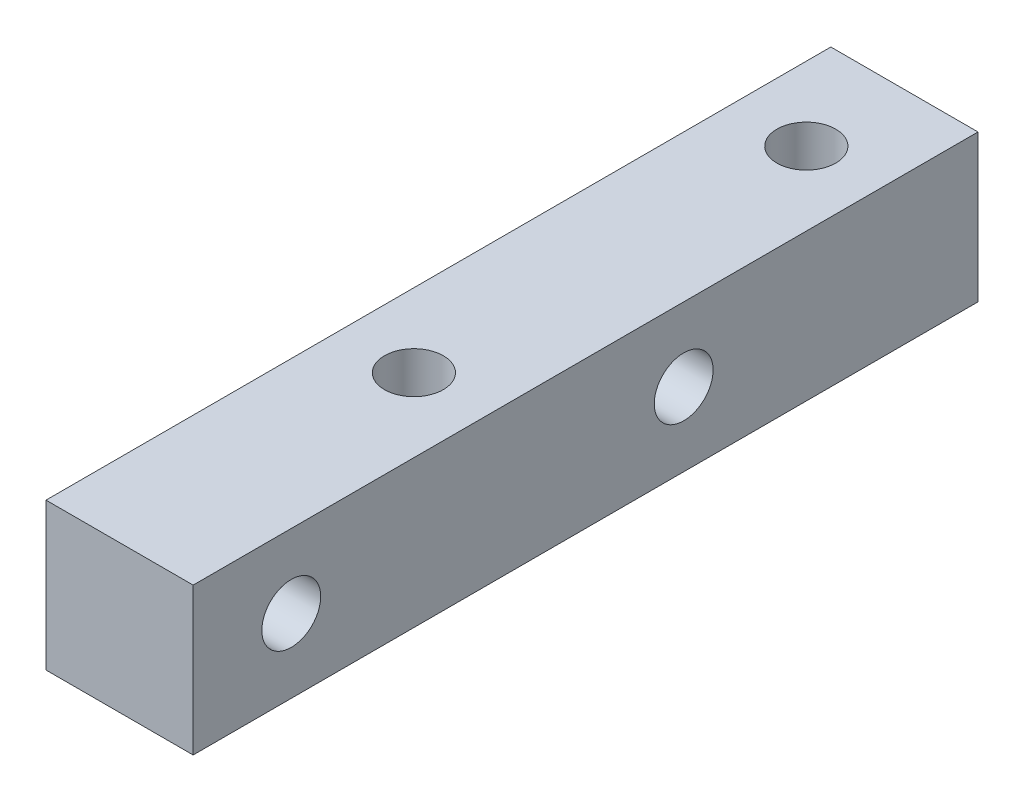
ISO-10303-21;
HEADER;
FILE_DESCRIPTION(('STEP AP214'),'2;1');
FILE_NAME('part.step','',(''),(''),'','','');
FILE_SCHEMA(('AUTOMOTIVE_DESIGN { 1 0 10303 214 1 1 1 1 }'));
ENDSEC;
DATA;
#1=APPLICATION_CONTEXT('core data for automotive mechanical design processes');
#2=APPLICATION_PROTOCOL_DEFINITION('international standard','automotive_design',2000,#1);
#3=PRODUCT_CONTEXT('',#1,'mechanical');
#4=PRODUCT('Part','Part','',(#3));
#5=PRODUCT_RELATED_PRODUCT_CATEGORY('part','',(#4));
#6=PRODUCT_DEFINITION_FORMATION('','',#4);
#7=PRODUCT_DEFINITION_CONTEXT('part definition',#1,'design');
#8=PRODUCT_DEFINITION('design','',#6,#7);
#9=PRODUCT_DEFINITION_SHAPE('','',#8);
#10=(LENGTH_UNIT() NAMED_UNIT(*) SI_UNIT(.MILLI.,.METRE.));
#11=(NAMED_UNIT(*) PLANE_ANGLE_UNIT() SI_UNIT($,.RADIAN.));
#12=(NAMED_UNIT(*) SI_UNIT($,.STERADIAN.) SOLID_ANGLE_UNIT());
#13=UNCERTAINTY_MEASURE_WITH_UNIT(LENGTH_MEASURE(1.E-05),#10,'distance_accuracy_value','');
#14=(GEOMETRIC_REPRESENTATION_CONTEXT(3) GLOBAL_UNCERTAINTY_ASSIGNED_CONTEXT((#13)) GLOBAL_UNIT_ASSIGNED_CONTEXT((#10,
#11,#12)) REPRESENTATION_CONTEXT('',''));
#15=CARTESIAN_POINT('',(0.,0.,0.));
#16=DIRECTION('',(0.,0.,1.));
#17=DIRECTION('',(1.,0.,0.));
#18=AXIS2_PLACEMENT_3D('',#15,#16,#17);
#19=CARTESIAN_POINT('',(0.,0.,32.));
#20=DIRECTION('',(1.,0.,0.));
#21=DIRECTION('',(0.,0.,-1.));
#22=AXIS2_PLACEMENT_3D('',#19,#20,#21);
#23=PLANE('',#22);
#24=CARTESIAN_POINT('',(0.,3.,28.));
#25=DIRECTION('',(-1.,0.,0.));
#26=DIRECTION('',(0.,0.,1.));
#27=AXIS2_PLACEMENT_3D('',#24,#25,#26);
#28=CIRCLE('',#27,1.2);
#29=CARTESIAN_POINT('',(0.,3.,29.2));
#30=VERTEX_POINT('',#29);
#31=EDGE_CURVE('E112',#30,#30,#28,.T.);
#32=ORIENTED_EDGE('',*,*,#31,.F.);
#33=EDGE_LOOP('',(#32));
#34=FACE_BOUND('',#33,.T.);
#35=CARTESIAN_POINT('',(0.,3.,12.));
#36=DIRECTION('',(-1.,0.,0.));
#37=DIRECTION('',(0.,0.,1.));
#38=AXIS2_PLACEMENT_3D('',#35,#36,#37);
#39=CIRCLE('',#38,1.2);
#40=CARTESIAN_POINT('',(0.,3.,13.2));
#41=VERTEX_POINT('',#40);
#42=EDGE_CURVE('E118',#41,#41,#39,.T.);
#43=ORIENTED_EDGE('',*,*,#42,.F.);
#44=EDGE_LOOP('',(#43));
#45=FACE_BOUND('',#44,.T.);
#46=DIRECTION('',(0.,-1.,0.));
#47=VECTOR('',#46,1.);
#48=CARTESIAN_POINT('',(0.,0.,0.));
#49=LINE('',#48,#47);
#50=CARTESIAN_POINT('',(0.,6.,0.));
#51=VERTEX_POINT('',#50);
#52=CARTESIAN_POINT('',(0.,0.,0.));
#53=VERTEX_POINT('',#52);
#54=EDGE_CURVE('E102',#51,#53,#49,.T.);
#55=ORIENTED_EDGE('',*,*,#54,.T.);
#56=DIRECTION('',(0.,0.,-1.));
#57=VECTOR('',#56,1.);
#58=CARTESIAN_POINT('',(0.,0.,32.));
#59=LINE('',#58,#57);
#60=CARTESIAN_POINT('',(0.,0.,32.));
#61=VERTEX_POINT('',#60);
#62=EDGE_CURVE('E11',#61,#53,#59,.T.);
#63=ORIENTED_EDGE('',*,*,#62,.F.);
#64=DIRECTION('',(0.,-1.,0.));
#65=VECTOR('',#64,1.);
#66=CARTESIAN_POINT('',(0.,0.,32.));
#67=LINE('',#66,#65);
#68=CARTESIAN_POINT('',(0.,6.,32.));
#69=VERTEX_POINT('',#68);
#70=EDGE_CURVE('E89',#69,#61,#67,.T.);
#71=ORIENTED_EDGE('',*,*,#70,.F.);
#72=DIRECTION('',(0.,0.,-1.));
#73=VECTOR('',#72,1.);
#74=CARTESIAN_POINT('',(0.,6.,32.));
#75=LINE('',#74,#73);
#76=EDGE_CURVE('E98',#69,#51,#75,.T.);
#77=ORIENTED_EDGE('',*,*,#76,.T.);
#78=EDGE_LOOP('',(#55,#63,#71,#77));
#79=FACE_BOUND('',#78,.T.);
#80=ADVANCED_FACE('F36',(#34,#45,#79),#23,.F.);
#81=CARTESIAN_POINT('',(0.,0.,32.));
#82=DIRECTION('',(0.,1.,0.));
#83=DIRECTION('',(0.,0.,1.));
#84=AXIS2_PLACEMENT_3D('',#81,#82,#83);
#85=PLANE('',#84);
#86=CARTESIAN_POINT('',(3.,0.,4.));
#87=DIRECTION('',(0.,1.,0.));
#88=DIRECTION('',(0.,0.,1.));
#89=AXIS2_PLACEMENT_3D('',#86,#87,#88);
#90=CIRCLE('',#89,1.2);
#91=CARTESIAN_POINT('',(3.,0.,5.2));
#92=VERTEX_POINT('',#91);
#93=EDGE_CURVE('E105',#92,#92,#90,.T.);
#94=ORIENTED_EDGE('',*,*,#93,.T.);
#95=EDGE_LOOP('',(#94));
#96=FACE_BOUND('',#95,.T.);
#97=CARTESIAN_POINT('',(3.,0.,20.));
#98=DIRECTION('',(0.,1.,0.));
#99=DIRECTION('',(0.,0.,1.));
#100=AXIS2_PLACEMENT_3D('',#97,#98,#99);
#101=CIRCLE('',#100,1.2);
#102=CARTESIAN_POINT('',(3.,0.,21.2));
#103=VERTEX_POINT('',#102);
#104=EDGE_CURVE('E128',#103,#103,#101,.T.);
#105=ORIENTED_EDGE('',*,*,#104,.T.);
#106=EDGE_LOOP('',(#105));
#107=FACE_BOUND('',#106,.T.);
#108=DIRECTION('',(1.,0.,0.));
#109=VECTOR('',#108,1.);
#110=CARTESIAN_POINT('',(0.,0.,0.));
#111=LINE('',#110,#109);
#112=CARTESIAN_POINT('',(6.,0.,0.));
#113=VERTEX_POINT('',#112);
#114=EDGE_CURVE('E93',#53,#113,#111,.T.);
#115=ORIENTED_EDGE('',*,*,#114,.T.);
#116=DIRECTION('',(0.,0.,-1.));
#117=VECTOR('',#116,1.);
#118=CARTESIAN_POINT('',(6.,0.,32.));
#119=LINE('',#118,#117);
#120=CARTESIAN_POINT('',(6.,0.,32.));
#121=VERTEX_POINT('',#120);
#122=EDGE_CURVE('E45',#121,#113,#119,.T.);
#123=ORIENTED_EDGE('',*,*,#122,.F.);
#124=DIRECTION('',(1.,0.,0.));
#125=VECTOR('',#124,1.);
#126=CARTESIAN_POINT('',(0.,0.,32.));
#127=LINE('',#126,#125);
#128=EDGE_CURVE('E84',#61,#121,#127,.T.);
#129=ORIENTED_EDGE('',*,*,#128,.F.);
#130=ORIENTED_EDGE('',*,*,#62,.T.);
#131=EDGE_LOOP('',(#115,#123,#129,#130));
#132=FACE_BOUND('',#131,.T.);
#133=ADVANCED_FACE('F92',(#96,#107,#132),#85,.F.);
#134=CARTESIAN_POINT('',(6.,0.,32.));
#135=DIRECTION('',(-1.,0.,0.));
#136=DIRECTION('',(0.,0.,1.));
#137=AXIS2_PLACEMENT_3D('',#134,#135,#136);
#138=PLANE('',#137);
#139=CARTESIAN_POINT('',(6.,3.,28.));
#140=DIRECTION('',(-1.,0.,0.));
#141=DIRECTION('',(0.,0.,1.));
#142=AXIS2_PLACEMENT_3D('',#139,#140,#141);
#143=CIRCLE('',#142,1.2);
#144=CARTESIAN_POINT('',(6.,3.,29.2));
#145=VERTEX_POINT('',#144);
#146=EDGE_CURVE('E39',#145,#145,#143,.T.);
#147=ORIENTED_EDGE('',*,*,#146,.T.);
#148=EDGE_LOOP('',(#147));
#149=FACE_BOUND('',#148,.T.);
#150=CARTESIAN_POINT('',(6.,3.,12.));
#151=DIRECTION('',(-1.,0.,0.));
#152=DIRECTION('',(0.,0.,1.));
#153=AXIS2_PLACEMENT_3D('',#150,#151,#152);
#154=CIRCLE('',#153,1.2);
#155=CARTESIAN_POINT('',(6.,3.,13.2));
#156=VERTEX_POINT('',#155);
#157=EDGE_CURVE('E110',#156,#156,#154,.T.);
#158=ORIENTED_EDGE('',*,*,#157,.T.);
#159=EDGE_LOOP('',(#158));
#160=FACE_BOUND('',#159,.T.);
#161=DIRECTION('',(0.,1.,0.));
#162=VECTOR('',#161,1.);
#163=CARTESIAN_POINT('',(6.,0.,0.));
#164=LINE('',#163,#162);
#165=CARTESIAN_POINT('',(6.,6.,0.));
#166=VERTEX_POINT('',#165);
#167=EDGE_CURVE('E71',#113,#166,#164,.T.);
#168=ORIENTED_EDGE('',*,*,#167,.T.);
#169=DIRECTION('',(0.,0.,-1.));
#170=VECTOR('',#169,1.);
#171=CARTESIAN_POINT('',(6.,6.,32.));
#172=LINE('',#171,#170);
#173=CARTESIAN_POINT('',(6.,6.,32.));
#174=VERTEX_POINT('',#173);
#175=EDGE_CURVE('E94',#174,#166,#172,.T.);
#176=ORIENTED_EDGE('',*,*,#175,.F.);
#177=DIRECTION('',(0.,1.,0.));
#178=VECTOR('',#177,1.);
#179=CARTESIAN_POINT('',(6.,0.,32.));
#180=LINE('',#179,#178);
#181=EDGE_CURVE('E87',#121,#174,#180,.T.);
#182=ORIENTED_EDGE('',*,*,#181,.F.);
#183=ORIENTED_EDGE('',*,*,#122,.T.);
#184=EDGE_LOOP('',(#168,#176,#182,#183));
#185=FACE_BOUND('',#184,.T.);
#186=ADVANCED_FACE('F96',(#149,#160,#185),#138,.F.);
#187=CARTESIAN_POINT('',(0.,6.,32.));
#188=DIRECTION('',(0.,-1.,0.));
#189=DIRECTION('',(0.,0.,-1.));
#190=AXIS2_PLACEMENT_3D('',#187,#188,#189);
#191=PLANE('',#190);
#192=CARTESIAN_POINT('',(3.,6.,4.));
#193=DIRECTION('',(0.,1.,0.));
#194=DIRECTION('',(0.,0.,1.));
#195=AXIS2_PLACEMENT_3D('',#192,#193,#194);
#196=CIRCLE('',#195,1.2);
#197=CARTESIAN_POINT('',(3.,6.,5.2));
#198=VERTEX_POINT('',#197);
#199=EDGE_CURVE('E125',#198,#198,#196,.T.);
#200=ORIENTED_EDGE('',*,*,#199,.F.);
#201=EDGE_LOOP('',(#200));
#202=FACE_BOUND('',#201,.T.);
#203=CARTESIAN_POINT('',(3.,6.,20.));
#204=DIRECTION('',(0.,1.,0.));
#205=DIRECTION('',(0.,0.,1.));
#206=AXIS2_PLACEMENT_3D('',#203,#204,#205);
#207=CIRCLE('',#206,1.2);
#208=CARTESIAN_POINT('',(3.,6.,21.2));
#209=VERTEX_POINT('',#208);
#210=EDGE_CURVE('E116',#209,#209,#207,.T.);
#211=ORIENTED_EDGE('',*,*,#210,.F.);
#212=EDGE_LOOP('',(#211));
#213=FACE_BOUND('',#212,.T.);
#214=DIRECTION('',(-1.,0.,0.));
#215=VECTOR('',#214,1.);
#216=CARTESIAN_POINT('',(0.,6.,0.));
#217=LINE('',#216,#215);
#218=EDGE_CURVE('E77',#166,#51,#217,.T.);
#219=ORIENTED_EDGE('',*,*,#218,.T.);
#220=ORIENTED_EDGE('',*,*,#76,.F.);
#221=DIRECTION('',(-1.,0.,0.));
#222=VECTOR('',#221,1.);
#223=CARTESIAN_POINT('',(0.,6.,32.));
#224=LINE('',#223,#222);
#225=EDGE_CURVE('E54',#174,#69,#224,.T.);
#226=ORIENTED_EDGE('',*,*,#225,.F.);
#227=ORIENTED_EDGE('',*,*,#175,.T.);
#228=EDGE_LOOP('',(#219,#220,#226,#227));
#229=FACE_BOUND('',#228,.T.);
#230=ADVANCED_FACE('F169',(#202,#213,#229),#191,.F.);
#231=CARTESIAN_POINT('',(0.,0.,32.));
#232=DIRECTION('',(0.,0.,-1.));
#233=DIRECTION('',(-1.,0.,0.));
#234=AXIS2_PLACEMENT_3D('',#231,#232,#233);
#235=PLANE('',#234);
#236=ORIENTED_EDGE('',*,*,#70,.T.);
#237=ORIENTED_EDGE('',*,*,#128,.T.);
#238=ORIENTED_EDGE('',*,*,#181,.T.);
#239=ORIENTED_EDGE('',*,*,#225,.T.);
#240=EDGE_LOOP('',(#236,#237,#238,#239));
#241=FACE_BOUND('',#240,.T.);
#242=ADVANCED_FACE('F85',(#241),#235,.F.);
#243=CARTESIAN_POINT('',(0.,0.,0.));
#244=DIRECTION('',(0.,0.,-1.));
#245=DIRECTION('',(-1.,0.,0.));
#246=AXIS2_PLACEMENT_3D('',#243,#244,#245);
#247=PLANE('',#246);
#248=ORIENTED_EDGE('',*,*,#54,.F.);
#249=ORIENTED_EDGE('',*,*,#218,.F.);
#250=ORIENTED_EDGE('',*,*,#167,.F.);
#251=ORIENTED_EDGE('',*,*,#114,.F.);
#252=EDGE_LOOP('',(#248,#249,#250,#251));
#253=FACE_BOUND('',#252,.T.);
#254=ADVANCED_FACE('F151',(#253),#247,.T.);
#255=CARTESIAN_POINT('',(3.,-44.,20.));
#256=DIRECTION('',(0.,1.,0.));
#257=DIRECTION('',(0.,0.,1.));
#258=AXIS2_PLACEMENT_3D('',#255,#256,#257);
#259=CYLINDRICAL_SURFACE('',#258,1.2);
#260=ORIENTED_EDGE('',*,*,#210,.T.);
#261=EDGE_LOOP('',(#260));
#262=FACE_BOUND('',#261,.T.);
#263=ORIENTED_EDGE('',*,*,#104,.F.);
#264=EDGE_LOOP('',(#263));
#265=FACE_BOUND('',#264,.T.);
#266=ADVANCED_FACE('F141',(#262,#265),#259,.F.);
#267=CARTESIAN_POINT('',(3.,-44.,4.));
#268=DIRECTION('',(0.,1.,0.));
#269=DIRECTION('',(0.,0.,1.));
#270=AXIS2_PLACEMENT_3D('',#267,#268,#269);
#271=CYLINDRICAL_SURFACE('',#270,1.2);
#272=ORIENTED_EDGE('',*,*,#199,.T.);
#273=EDGE_LOOP('',(#272));
#274=FACE_BOUND('',#273,.T.);
#275=ORIENTED_EDGE('',*,*,#93,.F.);
#276=EDGE_LOOP('',(#275));
#277=FACE_BOUND('',#276,.T.);
#278=ADVANCED_FACE('F138',(#274,#277),#271,.F.);
#279=CARTESIAN_POINT('',(50.,3.,12.));
#280=DIRECTION('',(-1.,0.,0.));
#281=DIRECTION('',(0.,0.,1.));
#282=AXIS2_PLACEMENT_3D('',#279,#280,#281);
#283=CYLINDRICAL_SURFACE('',#282,1.2);
#284=ORIENTED_EDGE('',*,*,#42,.T.);
#285=EDGE_LOOP('',(#284));
#286=FACE_BOUND('',#285,.T.);
#287=ORIENTED_EDGE('',*,*,#157,.F.);
#288=EDGE_LOOP('',(#287));
#289=FACE_BOUND('',#288,.T.);
#290=ADVANCED_FACE('F140',(#286,#289),#283,.F.);
#291=CARTESIAN_POINT('',(50.,3.,28.));
#292=DIRECTION('',(-1.,0.,0.));
#293=DIRECTION('',(0.,0.,1.));
#294=AXIS2_PLACEMENT_3D('',#291,#292,#293);
#295=CYLINDRICAL_SURFACE('',#294,1.2);
#296=ORIENTED_EDGE('',*,*,#31,.T.);
#297=EDGE_LOOP('',(#296));
#298=FACE_BOUND('',#297,.T.);
#299=ORIENTED_EDGE('',*,*,#146,.F.);
#300=EDGE_LOOP('',(#299));
#301=FACE_BOUND('',#300,.T.);
#302=ADVANCED_FACE('F148',(#298,#301),#295,.F.);
#303=CLOSED_SHELL('',(#80,#133,#186,#230,#242,#254,#266,#278,#290,#302));
#304=MANIFOLD_SOLID_BREP('B2',#303);
#305=ADVANCED_BREP_SHAPE_REPRESENTATION('',(#18,#304),#14);
#306=SHAPE_DEFINITION_REPRESENTATION(#9,#305);
ENDSEC;
END-ISO-10303-21;
